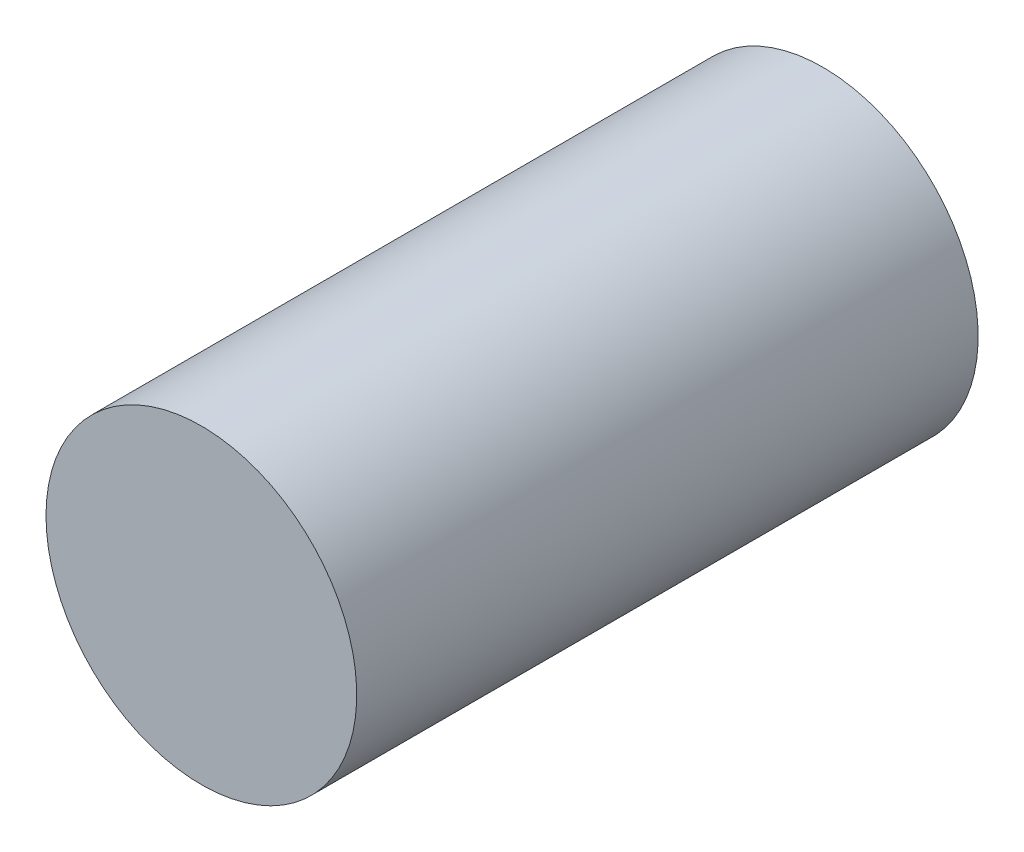
ISO-10303-21;
HEADER;
FILE_DESCRIPTION(('STEP AP214'),'2;1');
FILE_NAME('part.step','',(''),(''),'','','');
FILE_SCHEMA(('AUTOMOTIVE_DESIGN { 1 0 10303 214 1 1 1 1 }'));
ENDSEC;
DATA;
#1=APPLICATION_CONTEXT('core data for automotive mechanical design processes');
#2=APPLICATION_PROTOCOL_DEFINITION('international standard','automotive_design',2000,#1);
#3=PRODUCT_CONTEXT('',#1,'mechanical');
#4=PRODUCT('Part','Part','',(#3));
#5=PRODUCT_RELATED_PRODUCT_CATEGORY('part','',(#4));
#6=PRODUCT_DEFINITION_FORMATION('','',#4);
#7=PRODUCT_DEFINITION_CONTEXT('part definition',#1,'design');
#8=PRODUCT_DEFINITION('design','',#6,#7);
#9=PRODUCT_DEFINITION_SHAPE('','',#8);
#10=(LENGTH_UNIT() NAMED_UNIT(*) SI_UNIT(.MILLI.,.METRE.));
#11=(NAMED_UNIT(*) PLANE_ANGLE_UNIT() SI_UNIT($,.RADIAN.));
#12=(NAMED_UNIT(*) SI_UNIT($,.STERADIAN.) SOLID_ANGLE_UNIT());
#13=UNCERTAINTY_MEASURE_WITH_UNIT(LENGTH_MEASURE(1.E-05),#10,'distance_accuracy_value','');
#14=(GEOMETRIC_REPRESENTATION_CONTEXT(3) GLOBAL_UNCERTAINTY_ASSIGNED_CONTEXT((#13)) GLOBAL_UNIT_ASSIGNED_CONTEXT((#10,
#11,#12)) REPRESENTATION_CONTEXT('',''));
#15=CARTESIAN_POINT('',(0.,0.,0.));
#16=DIRECTION('',(0.,0.,1.));
#17=DIRECTION('',(1.,0.,0.));
#18=AXIS2_PLACEMENT_3D('',#15,#16,#17);
#19=CARTESIAN_POINT('',(-1.35959043774731E-13,0.,-1165.34071629779));
#20=DIRECTION('',(0.,0.,1.));
#21=DIRECTION('',(1.,0.,0.));
#22=AXIS2_PLACEMENT_3D('',#19,#20,#21);
#23=PLANE('',#22);
#24=CARTESIAN_POINT('',(-1.35959043774731E-13,0.,-1165.34071629779));
#25=DIRECTION('',(0.,0.,-1.));
#26=DIRECTION('',(-1.,0.,0.));
#27=AXIS2_PLACEMENT_3D('',#24,#25,#26);
#28=CIRCLE('',#27,304.8);
#29=CARTESIAN_POINT('',(-304.8,0.,-1165.34071629779));
#30=VERTEX_POINT('',#29);
#31=EDGE_CURVE('E10',#30,#30,#28,.T.);
#32=ORIENTED_EDGE('',*,*,#31,.T.);
#33=EDGE_LOOP('',(#32));
#34=FACE_BOUND('',#33,.T.);
#35=ADVANCED_FACE('F30',(#34),#23,.F.);
#36=CARTESIAN_POINT('',(-1.35959043774731E-13,0.,-1165.34071629779));
#37=DIRECTION('',(0.,0.,-1.));
#38=DIRECTION('',(-1.,0.,0.));
#39=AXIS2_PLACEMENT_3D('',#36,#37,#38);
#40=CYLINDRICAL_SURFACE('',#39,304.8);
#41=ORIENTED_EDGE('',*,*,#31,.F.);
#42=EDGE_LOOP('',(#41));
#43=FACE_BOUND('',#42,.T.);
#44=CARTESIAN_POINT('',(0.,0.,53.8592837022134));
#45=DIRECTION('',(0.,0.,-1.));
#46=DIRECTION('',(-1.,0.,0.));
#47=AXIS2_PLACEMENT_3D('',#44,#45,#46);
#48=CIRCLE('',#47,304.8);
#49=CARTESIAN_POINT('',(-304.8,0.,53.8592837022134));
#50=VERTEX_POINT('',#49);
#51=EDGE_CURVE('E36',#50,#50,#48,.T.);
#52=ORIENTED_EDGE('',*,*,#51,.T.);
#53=EDGE_LOOP('',(#52));
#54=FACE_BOUND('',#53,.T.);
#55=ADVANCED_FACE('F42',(#43,#54),#40,.T.);
#56=CARTESIAN_POINT('',(0.,0.,53.8592837022133));
#57=DIRECTION('',(0.,0.,-1.));
#58=DIRECTION('',(-1.,0.,0.));
#59=AXIS2_PLACEMENT_3D('',#56,#57,#58);
#60=PLANE('',#59);
#61=ORIENTED_EDGE('',*,*,#51,.F.);
#62=EDGE_LOOP('',(#61));
#63=FACE_BOUND('',#62,.T.);
#64=ADVANCED_FACE('F44',(#63),#60,.F.);
#65=CLOSED_SHELL('',(#35,#55,#64));
#66=MANIFOLD_SOLID_BREP('B2',#65);
#67=ADVANCED_BREP_SHAPE_REPRESENTATION('',(#18,#66),#14);
#68=SHAPE_DEFINITION_REPRESENTATION(#9,#67);
ENDSEC;
END-ISO-10303-21;
